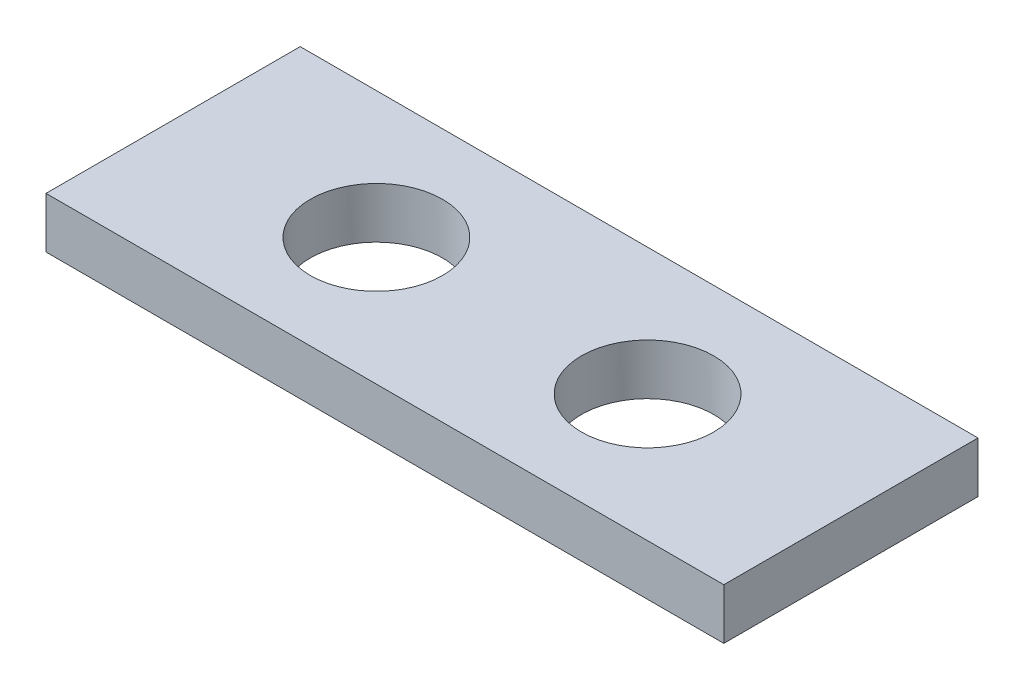
ISO-10303-21;
HEADER;
FILE_DESCRIPTION(('STEP AP214'),'2;1');
FILE_NAME('part.step','',(''),(''),'','','');
FILE_SCHEMA(('AUTOMOTIVE_DESIGN { 1 0 10303 214 1 1 1 1 }'));
ENDSEC;
DATA;
#1=APPLICATION_CONTEXT('core data for automotive mechanical design processes');
#2=APPLICATION_PROTOCOL_DEFINITION('international standard','automotive_design',2000,#1);
#3=PRODUCT_CONTEXT('',#1,'mechanical');
#4=PRODUCT('Part','Part','',(#3));
#5=PRODUCT_RELATED_PRODUCT_CATEGORY('part','',(#4));
#6=PRODUCT_DEFINITION_FORMATION('','',#4);
#7=PRODUCT_DEFINITION_CONTEXT('part definition',#1,'design');
#8=PRODUCT_DEFINITION('design','',#6,#7);
#9=PRODUCT_DEFINITION_SHAPE('','',#8);
#10=(LENGTH_UNIT() NAMED_UNIT(*) SI_UNIT(.MILLI.,.METRE.));
#11=(NAMED_UNIT(*) PLANE_ANGLE_UNIT() SI_UNIT($,.RADIAN.));
#12=(NAMED_UNIT(*) SI_UNIT($,.STERADIAN.) SOLID_ANGLE_UNIT());
#13=UNCERTAINTY_MEASURE_WITH_UNIT(LENGTH_MEASURE(1.E-05),#10,'distance_accuracy_value','');
#14=(GEOMETRIC_REPRESENTATION_CONTEXT(3) GLOBAL_UNCERTAINTY_ASSIGNED_CONTEXT((#13)) GLOBAL_UNIT_ASSIGNED_CONTEXT((#10,
#11,#12)) REPRESENTATION_CONTEXT('',''));
#15=CARTESIAN_POINT('',(0.,0.,0.));
#16=DIRECTION('',(0.,0.,1.));
#17=DIRECTION('',(1.,0.,0.));
#18=AXIS2_PLACEMENT_3D('',#15,#16,#17);
#19=CARTESIAN_POINT('',(20.,3.,7.5));
#20=DIRECTION('',(-1.,0.,0.));
#21=DIRECTION('',(0.,0.,1.));
#22=AXIS2_PLACEMENT_3D('',#19,#20,#21);
#23=PLANE('',#22);
#24=DIRECTION('',(0.,0.,-1.));
#25=VECTOR('',#24,1.);
#26=CARTESIAN_POINT('',(20.,0.,7.5));
#27=LINE('',#26,#25);
#28=CARTESIAN_POINT('',(20.,0.,7.5));
#29=VERTEX_POINT('',#28);
#30=CARTESIAN_POINT('',(20.,0.,-7.5));
#31=VERTEX_POINT('',#30);
#32=EDGE_CURVE('E96',#29,#31,#27,.T.);
#33=ORIENTED_EDGE('',*,*,#32,.T.);
#34=DIRECTION('',(0.,-1.,0.));
#35=VECTOR('',#34,1.);
#36=CARTESIAN_POINT('',(20.,3.,-7.5));
#37=LINE('',#36,#35);
#38=CARTESIAN_POINT('',(20.,3.,-7.5));
#39=VERTEX_POINT('',#38);
#40=EDGE_CURVE('E11',#39,#31,#37,.T.);
#41=ORIENTED_EDGE('',*,*,#40,.F.);
#42=DIRECTION('',(0.,0.,-1.));
#43=VECTOR('',#42,1.);
#44=CARTESIAN_POINT('',(20.,3.,7.5));
#45=LINE('',#44,#43);
#46=CARTESIAN_POINT('',(20.,3.,7.5));
#47=VERTEX_POINT('',#46);
#48=EDGE_CURVE('E84',#47,#39,#45,.T.);
#49=ORIENTED_EDGE('',*,*,#48,.F.);
#50=DIRECTION('',(0.,-1.,0.));
#51=VECTOR('',#50,1.);
#52=CARTESIAN_POINT('',(20.,3.,7.5));
#53=LINE('',#52,#51);
#54=EDGE_CURVE('E92',#47,#29,#53,.T.);
#55=ORIENTED_EDGE('',*,*,#54,.T.);
#56=EDGE_LOOP('',(#33,#41,#49,#55));
#57=FACE_BOUND('',#56,.T.);
#58=ADVANCED_FACE('F33',(#57),#23,.F.);
#59=CARTESIAN_POINT('',(-20.,3.,-7.5));
#60=DIRECTION('',(0.,0.,1.));
#61=DIRECTION('',(1.,0.,0.));
#62=AXIS2_PLACEMENT_3D('',#59,#60,#61);
#63=PLANE('',#62);
#64=DIRECTION('',(-1.,0.,0.));
#65=VECTOR('',#64,1.);
#66=CARTESIAN_POINT('',(-20.,0.,-7.5));
#67=LINE('',#66,#65);
#68=CARTESIAN_POINT('',(-20.,0.,-7.5));
#69=VERTEX_POINT('',#68);
#70=EDGE_CURVE('E88',#31,#69,#67,.T.);
#71=ORIENTED_EDGE('',*,*,#70,.T.);
#72=DIRECTION('',(0.,-1.,0.));
#73=VECTOR('',#72,1.);
#74=CARTESIAN_POINT('',(-20.,3.,-7.5));
#75=LINE('',#74,#73);
#76=CARTESIAN_POINT('',(-20.,3.,-7.5));
#77=VERTEX_POINT('',#76);
#78=EDGE_CURVE('E41',#77,#69,#75,.T.);
#79=ORIENTED_EDGE('',*,*,#78,.F.);
#80=DIRECTION('',(-1.,0.,0.));
#81=VECTOR('',#80,1.);
#82=CARTESIAN_POINT('',(-20.,3.,-7.5));
#83=LINE('',#82,#81);
#84=EDGE_CURVE('E79',#39,#77,#83,.T.);
#85=ORIENTED_EDGE('',*,*,#84,.F.);
#86=ORIENTED_EDGE('',*,*,#40,.T.);
#87=EDGE_LOOP('',(#71,#79,#85,#86));
#88=FACE_BOUND('',#87,.T.);
#89=ADVANCED_FACE('F87',(#88),#63,.F.);
#90=CARTESIAN_POINT('',(-20.,3.,7.5));
#91=DIRECTION('',(1.,0.,0.));
#92=DIRECTION('',(0.,0.,-1.));
#93=AXIS2_PLACEMENT_3D('',#90,#91,#92);
#94=PLANE('',#93);
#95=DIRECTION('',(0.,0.,1.));
#96=VECTOR('',#95,1.);
#97=CARTESIAN_POINT('',(-20.,0.,7.5));
#98=LINE('',#97,#96);
#99=CARTESIAN_POINT('',(-20.,0.,7.5));
#100=VERTEX_POINT('',#99);
#101=EDGE_CURVE('E66',#69,#100,#98,.T.);
#102=ORIENTED_EDGE('',*,*,#101,.T.);
#103=DIRECTION('',(0.,-1.,0.));
#104=VECTOR('',#103,1.);
#105=CARTESIAN_POINT('',(-20.,3.,7.5));
#106=LINE('',#105,#104);
#107=CARTESIAN_POINT('',(-20.,3.,7.5));
#108=VERTEX_POINT('',#107);
#109=EDGE_CURVE('E89',#108,#100,#106,.T.);
#110=ORIENTED_EDGE('',*,*,#109,.F.);
#111=DIRECTION('',(0.,0.,1.));
#112=VECTOR('',#111,1.);
#113=CARTESIAN_POINT('',(-20.,3.,7.5));
#114=LINE('',#113,#112);
#115=EDGE_CURVE('E82',#77,#108,#114,.T.);
#116=ORIENTED_EDGE('',*,*,#115,.F.);
#117=ORIENTED_EDGE('',*,*,#78,.T.);
#118=EDGE_LOOP('',(#102,#110,#116,#117));
#119=FACE_BOUND('',#118,.T.);
#120=ADVANCED_FACE('F90',(#119),#94,.F.);
#121=CARTESIAN_POINT('',(-20.,3.,7.5));
#122=DIRECTION('',(0.,0.,-1.));
#123=DIRECTION('',(-1.,0.,0.));
#124=AXIS2_PLACEMENT_3D('',#121,#122,#123);
#125=PLANE('',#124);
#126=DIRECTION('',(1.,0.,0.));
#127=VECTOR('',#126,1.);
#128=CARTESIAN_POINT('',(-20.,0.,7.5));
#129=LINE('',#128,#127);
#130=EDGE_CURVE('E72',#100,#29,#129,.T.);
#131=ORIENTED_EDGE('',*,*,#130,.T.);
#132=ORIENTED_EDGE('',*,*,#54,.F.);
#133=DIRECTION('',(1.,0.,0.));
#134=VECTOR('',#133,1.);
#135=CARTESIAN_POINT('',(-20.,3.,7.5));
#136=LINE('',#135,#134);
#137=EDGE_CURVE('E49',#108,#47,#136,.T.);
#138=ORIENTED_EDGE('',*,*,#137,.F.);
#139=ORIENTED_EDGE('',*,*,#109,.T.);
#140=EDGE_LOOP('',(#131,#132,#138,#139));
#141=FACE_BOUND('',#140,.T.);
#142=ADVANCED_FACE('F104',(#141),#125,.F.);
#143=CARTESIAN_POINT('',(0.,3.,0.));
#144=DIRECTION('',(0.,-1.,0.));
#145=DIRECTION('',(0.,0.,-1.));
#146=AXIS2_PLACEMENT_3D('',#143,#144,#145);
#147=PLANE('',#146);
#148=CARTESIAN_POINT('',(8.,3.,0.));
#149=DIRECTION('',(0.,-1.,0.));
#150=DIRECTION('',(0.,0.,-1.));
#151=AXIS2_PLACEMENT_3D('',#148,#149,#150);
#152=CIRCLE('',#151,3.9);
#153=CARTESIAN_POINT('',(8.,3.,-3.9));
#154=VERTEX_POINT('',#153);
#155=EDGE_CURVE('E115',#154,#154,#152,.F.);
#156=ORIENTED_EDGE('',*,*,#155,.F.);
#157=EDGE_LOOP('',(#156));
#158=FACE_BOUND('',#157,.T.);
#159=CARTESIAN_POINT('',(-8.,3.,0.));
#160=DIRECTION('',(0.,-1.,0.));
#161=DIRECTION('',(0.,0.,-1.));
#162=AXIS2_PLACEMENT_3D('',#159,#160,#161);
#163=CIRCLE('',#162,3.9);
#164=CARTESIAN_POINT('',(-8.,3.,-3.9));
#165=VERTEX_POINT('',#164);
#166=EDGE_CURVE('E99',#165,#165,#163,.T.);
#167=ORIENTED_EDGE('',*,*,#166,.T.);
#168=EDGE_LOOP('',(#167));
#169=FACE_BOUND('',#168,.T.);
#170=ORIENTED_EDGE('',*,*,#48,.T.);
#171=ORIENTED_EDGE('',*,*,#84,.T.);
#172=ORIENTED_EDGE('',*,*,#115,.T.);
#173=ORIENTED_EDGE('',*,*,#137,.T.);
#174=EDGE_LOOP('',(#170,#171,#172,#173));
#175=FACE_BOUND('',#174,.T.);
#176=ADVANCED_FACE('F80',(#158,#169,#175),#147,.F.);
#177=CARTESIAN_POINT('',(0.,0.,0.));
#178=DIRECTION('',(0.,-1.,0.));
#179=DIRECTION('',(0.,0.,-1.));
#180=AXIS2_PLACEMENT_3D('',#177,#178,#179);
#181=PLANE('',#180);
#182=CARTESIAN_POINT('',(8.,0.,0.));
#183=DIRECTION('',(0.,-1.,0.));
#184=DIRECTION('',(0.,0.,1.));
#185=AXIS2_PLACEMENT_3D('',#182,#183,#184);
#186=CIRCLE('',#185,3.9);
#187=CARTESIAN_POINT('',(8.,0.,3.9));
#188=VERTEX_POINT('',#187);
#189=EDGE_CURVE('E118',#188,#188,#186,.T.);
#190=ORIENTED_EDGE('',*,*,#189,.F.);
#191=EDGE_LOOP('',(#190));
#192=FACE_BOUND('',#191,.T.);
#193=CARTESIAN_POINT('',(-8.,0.,0.));
#194=DIRECTION('',(0.,1.,0.));
#195=DIRECTION('',(0.,0.,1.));
#196=AXIS2_PLACEMENT_3D('',#193,#194,#195);
#197=CIRCLE('',#196,3.9);
#198=CARTESIAN_POINT('',(-8.,0.,3.9));
#199=VERTEX_POINT('',#198);
#200=EDGE_CURVE('E112',#199,#199,#197,.T.);
#201=ORIENTED_EDGE('',*,*,#200,.T.);
#202=EDGE_LOOP('',(#201));
#203=FACE_BOUND('',#202,.T.);
#204=ORIENTED_EDGE('',*,*,#32,.F.);
#205=ORIENTED_EDGE('',*,*,#130,.F.);
#206=ORIENTED_EDGE('',*,*,#101,.F.);
#207=ORIENTED_EDGE('',*,*,#70,.F.);
#208=EDGE_LOOP('',(#204,#205,#206,#207));
#209=FACE_BOUND('',#208,.T.);
#210=ADVANCED_FACE('F107',(#192,#203,#209),#181,.T.);
#211=CARTESIAN_POINT('',(-8.,0.,0.));
#212=DIRECTION('',(0.,1.,0.));
#213=DIRECTION('',(0.,0.,1.));
#214=AXIS2_PLACEMENT_3D('',#211,#212,#213);
#215=CYLINDRICAL_SURFACE('',#214,3.9);
#216=ORIENTED_EDGE('',*,*,#200,.F.);
#217=EDGE_LOOP('',(#216));
#218=FACE_BOUND('',#217,.T.);
#219=ORIENTED_EDGE('',*,*,#166,.F.);
#220=EDGE_LOOP('',(#219));
#221=FACE_BOUND('',#220,.T.);
#222=ADVANCED_FACE('F127',(#218,#221),#215,.F.);
#223=CARTESIAN_POINT('',(8.,0.,0.));
#224=DIRECTION('',(0.,1.,0.));
#225=DIRECTION('',(0.,0.,1.));
#226=AXIS2_PLACEMENT_3D('',#223,#224,#225);
#227=CYLINDRICAL_SURFACE('',#226,3.9);
#228=ORIENTED_EDGE('',*,*,#189,.T.);
#229=EDGE_LOOP('',(#228));
#230=FACE_BOUND('',#229,.T.);
#231=ORIENTED_EDGE('',*,*,#155,.T.);
#232=EDGE_LOOP('',(#231));
#233=FACE_BOUND('',#232,.T.);
#234=ADVANCED_FACE('F122',(#230,#233),#227,.F.);
#235=CLOSED_SHELL('',(#58,#89,#120,#142,#176,#210,#222,#234));
#236=MANIFOLD_SOLID_BREP('B2',#235);
#237=ADVANCED_BREP_SHAPE_REPRESENTATION('',(#18,#236),#14);
#238=SHAPE_DEFINITION_REPRESENTATION(#9,#237);
ENDSEC;
END-ISO-10303-21;
